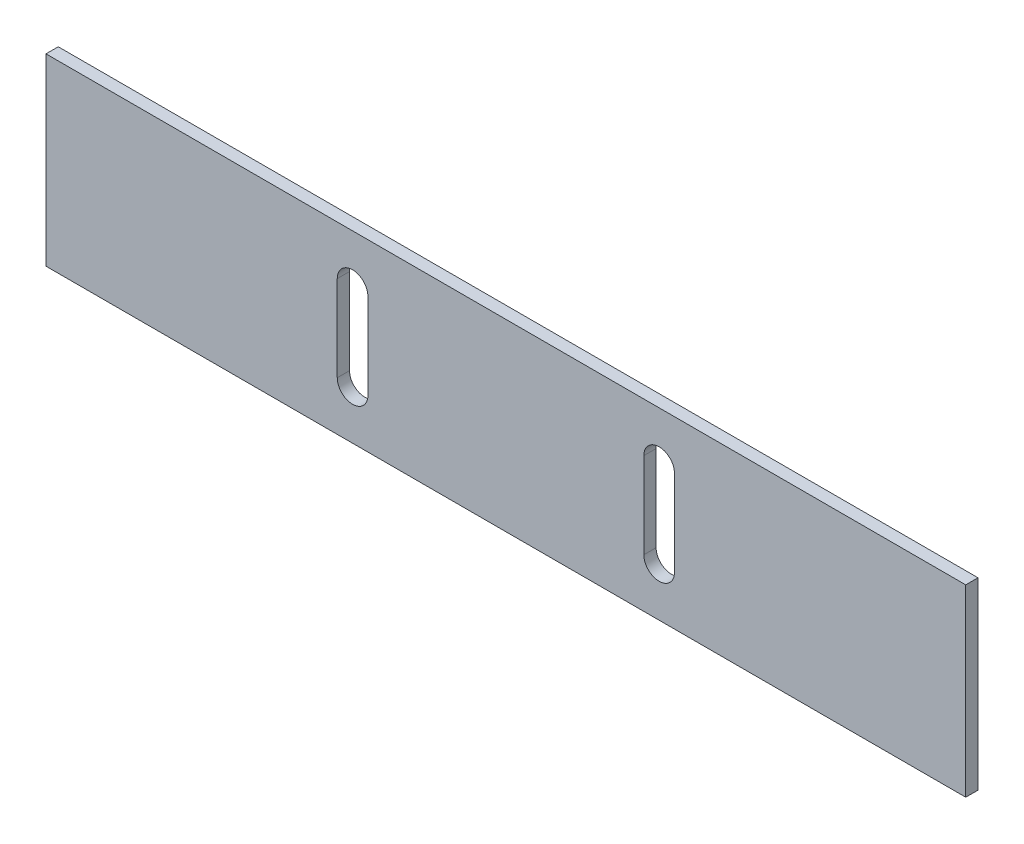
ISO-10303-21;
HEADER;
FILE_DESCRIPTION(('STEP AP214'),'2;1');
FILE_NAME('part.step','',(''),(''),'','','');
FILE_SCHEMA(('AUTOMOTIVE_DESIGN { 1 0 10303 214 1 1 1 1 }'));
ENDSEC;
DATA;
#1=APPLICATION_CONTEXT('core data for automotive mechanical design processes');
#2=APPLICATION_PROTOCOL_DEFINITION('international standard','automotive_design',2000,#1);
#3=PRODUCT_CONTEXT('',#1,'mechanical');
#4=PRODUCT('Part','Part','',(#3));
#5=PRODUCT_RELATED_PRODUCT_CATEGORY('part','',(#4));
#6=PRODUCT_DEFINITION_FORMATION('','',#4);
#7=PRODUCT_DEFINITION_CONTEXT('part definition',#1,'design');
#8=PRODUCT_DEFINITION('design','',#6,#7);
#9=PRODUCT_DEFINITION_SHAPE('','',#8);
#10=(LENGTH_UNIT() NAMED_UNIT(*) SI_UNIT(.MILLI.,.METRE.));
#11=(NAMED_UNIT(*) PLANE_ANGLE_UNIT() SI_UNIT($,.RADIAN.));
#12=(NAMED_UNIT(*) SI_UNIT($,.STERADIAN.) SOLID_ANGLE_UNIT());
#13=UNCERTAINTY_MEASURE_WITH_UNIT(LENGTH_MEASURE(1.E-05),#10,'distance_accuracy_value','');
#14=(GEOMETRIC_REPRESENTATION_CONTEXT(3) GLOBAL_UNCERTAINTY_ASSIGNED_CONTEXT((#13)) GLOBAL_UNIT_ASSIGNED_CONTEXT((#10,
#11,#12)) REPRESENTATION_CONTEXT('',''));
#15=CARTESIAN_POINT('',(0.,0.,0.));
#16=DIRECTION('',(0.,0.,1.));
#17=DIRECTION('',(1.,0.,0.));
#18=AXIS2_PLACEMENT_3D('',#15,#16,#17);
#19=CARTESIAN_POINT('',(0.,0.,2.));
#20=DIRECTION('',(0.,0.,-1.));
#21=DIRECTION('',(-1.,0.,0.));
#22=AXIS2_PLACEMENT_3D('',#19,#20,#21);
#23=PLANE('',#22);
#24=CARTESIAN_POINT('',(50.,22.,2.));
#25=DIRECTION('',(0.,0.,1.));
#26=DIRECTION('',(-1.,0.,0.));
#27=AXIS2_PLACEMENT_3D('',#24,#25,#26);
#28=CIRCLE('',#27,2.5);
#29=CARTESIAN_POINT('',(52.5,22.,2.));
#30=VERTEX_POINT('',#29);
#31=CARTESIAN_POINT('',(47.5,22.,2.));
#32=VERTEX_POINT('',#31);
#33=EDGE_CURVE('E161',#30,#32,#28,.T.);
#34=ORIENTED_EDGE('',*,*,#33,.F.);
#35=DIRECTION('',(0.,1.,0.));
#36=VECTOR('',#35,1.);
#37=CARTESIAN_POINT('',(52.5,22.,2.));
#38=LINE('',#37,#36);
#39=CARTESIAN_POINT('',(52.5,8.,2.));
#40=VERTEX_POINT('',#39);
#41=EDGE_CURVE('E169',#40,#30,#38,.T.);
#42=ORIENTED_EDGE('',*,*,#41,.F.);
#43=CARTESIAN_POINT('',(50.,8.,2.));
#44=DIRECTION('',(0.,0.,1.));
#45=DIRECTION('',(1.,0.,0.));
#46=AXIS2_PLACEMENT_3D('',#43,#44,#45);
#47=CIRCLE('',#46,2.5);
#48=CARTESIAN_POINT('',(47.5,8.,2.));
#49=VERTEX_POINT('',#48);
#50=EDGE_CURVE('E166',#49,#40,#47,.T.);
#51=ORIENTED_EDGE('',*,*,#50,.F.);
#52=DIRECTION('',(0.,-1.,0.));
#53=VECTOR('',#52,1.);
#54=CARTESIAN_POINT('',(47.5,8.,2.));
#55=LINE('',#54,#53);
#56=EDGE_CURVE('E163',#32,#49,#55,.T.);
#57=ORIENTED_EDGE('',*,*,#56,.F.);
#58=EDGE_LOOP('',(#34,#42,#51,#57));
#59=FACE_BOUND('',#58,.T.);
#60=DIRECTION('',(0.,-1.,0.));
#61=VECTOR('',#60,1.);
#62=CARTESIAN_POINT('',(0.,0.,2.));
#63=LINE('',#62,#61);
#64=CARTESIAN_POINT('',(0.,30.,2.));
#65=VERTEX_POINT('',#64);
#66=CARTESIAN_POINT('',(0.,0.,2.));
#67=VERTEX_POINT('',#66);
#68=EDGE_CURVE('E192',#65,#67,#63,.T.);
#69=ORIENTED_EDGE('',*,*,#68,.T.);
#70=DIRECTION('',(1.,0.,0.));
#71=VECTOR('',#70,1.);
#72=CARTESIAN_POINT('',(0.,0.,2.));
#73=LINE('',#72,#71);
#74=CARTESIAN_POINT('',(150.,0.,2.));
#75=VERTEX_POINT('',#74);
#76=EDGE_CURVE('E195',#67,#75,#73,.T.);
#77=ORIENTED_EDGE('',*,*,#76,.T.);
#78=DIRECTION('',(0.,1.,0.));
#79=VECTOR('',#78,1.);
#80=CARTESIAN_POINT('',(150.,0.,2.));
#81=LINE('',#80,#79);
#82=CARTESIAN_POINT('',(150.,30.,2.));
#83=VERTEX_POINT('',#82);
#84=EDGE_CURVE('E198',#75,#83,#81,.T.);
#85=ORIENTED_EDGE('',*,*,#84,.T.);
#86=DIRECTION('',(-1.,0.,0.));
#87=VECTOR('',#86,1.);
#88=CARTESIAN_POINT('',(0.,30.,2.));
#89=LINE('',#88,#87);
#90=EDGE_CURVE('E200',#83,#65,#89,.T.);
#91=ORIENTED_EDGE('',*,*,#90,.T.);
#92=EDGE_LOOP('',(#69,#77,#85,#91));
#93=FACE_BOUND('',#92,.T.);
#94=CARTESIAN_POINT('',(100.,22.,2.));
#95=DIRECTION('',(0.,0.,1.));
#96=DIRECTION('',(-1.,0.,0.));
#97=AXIS2_PLACEMENT_3D('',#94,#95,#96);
#98=CIRCLE('',#97,2.5);
#99=CARTESIAN_POINT('',(102.5,22.,2.));
#100=VERTEX_POINT('',#99);
#101=CARTESIAN_POINT('',(97.5,22.,2.));
#102=VERTEX_POINT('',#101);
#103=EDGE_CURVE('E125',#100,#102,#98,.T.);
#104=ORIENTED_EDGE('',*,*,#103,.F.);
#105=DIRECTION('',(0.,1.,0.));
#106=VECTOR('',#105,1.);
#107=CARTESIAN_POINT('',(102.5,22.,2.));
#108=LINE('',#107,#106);
#109=CARTESIAN_POINT('',(102.5,8.,2.));
#110=VERTEX_POINT('',#109);
#111=EDGE_CURVE('E147',#110,#100,#108,.T.);
#112=ORIENTED_EDGE('',*,*,#111,.F.);
#113=CARTESIAN_POINT('',(100.,8.,2.));
#114=DIRECTION('',(0.,0.,1.));
#115=DIRECTION('',(1.,0.,0.));
#116=AXIS2_PLACEMENT_3D('',#113,#114,#115);
#117=CIRCLE('',#116,2.5);
#118=CARTESIAN_POINT('',(97.5,8.,2.));
#119=VERTEX_POINT('',#118);
#120=EDGE_CURVE('E145',#119,#110,#117,.T.);
#121=ORIENTED_EDGE('',*,*,#120,.F.);
#122=DIRECTION('',(0.,-1.,0.));
#123=VECTOR('',#122,1.);
#124=CARTESIAN_POINT('',(97.5,8.,2.));
#125=LINE('',#124,#123);
#126=EDGE_CURVE('E133',#102,#119,#125,.T.);
#127=ORIENTED_EDGE('',*,*,#126,.F.);
#128=EDGE_LOOP('',(#104,#112,#121,#127));
#129=FACE_BOUND('',#128,.T.);
#130=ADVANCED_FACE('F36',(#59,#93,#129),#23,.F.);
#131=CARTESIAN_POINT('',(0.,0.,0.));
#132=DIRECTION('',(0.,0.,-1.));
#133=DIRECTION('',(-1.,0.,0.));
#134=AXIS2_PLACEMENT_3D('',#131,#132,#133);
#135=PLANE('',#134);
#136=DIRECTION('',(0.,-1.,0.));
#137=VECTOR('',#136,1.);
#138=CARTESIAN_POINT('',(0.,0.,0.));
#139=LINE('',#138,#137);
#140=CARTESIAN_POINT('',(0.,30.,0.));
#141=VERTEX_POINT('',#140);
#142=CARTESIAN_POINT('',(0.,0.,0.));
#143=VERTEX_POINT('',#142);
#144=EDGE_CURVE('E191',#141,#143,#139,.T.);
#145=ORIENTED_EDGE('',*,*,#144,.F.);
#146=DIRECTION('',(-1.,0.,0.));
#147=VECTOR('',#146,1.);
#148=CARTESIAN_POINT('',(0.,30.,0.));
#149=LINE('',#148,#147);
#150=CARTESIAN_POINT('',(150.,30.,0.));
#151=VERTEX_POINT('',#150);
#152=EDGE_CURVE('E196',#151,#141,#149,.T.);
#153=ORIENTED_EDGE('',*,*,#152,.F.);
#154=DIRECTION('',(0.,1.,0.));
#155=VECTOR('',#154,1.);
#156=CARTESIAN_POINT('',(150.,0.,0.));
#157=LINE('',#156,#155);
#158=CARTESIAN_POINT('',(150.,0.,0.));
#159=VERTEX_POINT('',#158);
#160=EDGE_CURVE('E207',#159,#151,#157,.T.);
#161=ORIENTED_EDGE('',*,*,#160,.F.);
#162=DIRECTION('',(1.,0.,0.));
#163=VECTOR('',#162,1.);
#164=CARTESIAN_POINT('',(0.,0.,0.));
#165=LINE('',#164,#163);
#166=EDGE_CURVE('E205',#143,#159,#165,.T.);
#167=ORIENTED_EDGE('',*,*,#166,.F.);
#168=EDGE_LOOP('',(#145,#153,#161,#167));
#169=FACE_BOUND('',#168,.T.);
#170=DIRECTION('',(0.,1.,0.));
#171=VECTOR('',#170,1.);
#172=CARTESIAN_POINT('',(52.5,22.,0.));
#173=LINE('',#172,#171);
#174=CARTESIAN_POINT('',(52.5,8.,0.));
#175=VERTEX_POINT('',#174);
#176=CARTESIAN_POINT('',(52.5,22.,0.));
#177=VERTEX_POINT('',#176);
#178=EDGE_CURVE('E164',#175,#177,#173,.T.);
#179=ORIENTED_EDGE('',*,*,#178,.T.);
#180=CARTESIAN_POINT('',(50.,22.,0.));
#181=DIRECTION('',(0.,0.,1.));
#182=DIRECTION('',(-1.,0.,0.));
#183=AXIS2_PLACEMENT_3D('',#180,#181,#182);
#184=CIRCLE('',#183,2.5);
#185=CARTESIAN_POINT('',(47.5,22.,0.));
#186=VERTEX_POINT('',#185);
#187=EDGE_CURVE('E141',#177,#186,#184,.T.);
#188=ORIENTED_EDGE('',*,*,#187,.T.);
#189=DIRECTION('',(0.,-1.,0.));
#190=VECTOR('',#189,1.);
#191=CARTESIAN_POINT('',(47.5,8.,0.));
#192=LINE('',#191,#190);
#193=CARTESIAN_POINT('',(47.5,8.,0.));
#194=VERTEX_POINT('',#193);
#195=EDGE_CURVE('E174',#186,#194,#192,.T.);
#196=ORIENTED_EDGE('',*,*,#195,.T.);
#197=CARTESIAN_POINT('',(50.,8.,0.));
#198=DIRECTION('',(0.,0.,1.));
#199=DIRECTION('',(1.,0.,0.));
#200=AXIS2_PLACEMENT_3D('',#197,#198,#199);
#201=CIRCLE('',#200,2.5);
#202=EDGE_CURVE('E177',#194,#175,#201,.T.);
#203=ORIENTED_EDGE('',*,*,#202,.T.);
#204=EDGE_LOOP('',(#179,#188,#196,#203));
#205=FACE_BOUND('',#204,.T.);
#206=DIRECTION('',(0.,1.,0.));
#207=VECTOR('',#206,1.);
#208=CARTESIAN_POINT('',(102.5,22.,0.));
#209=LINE('',#208,#207);
#210=CARTESIAN_POINT('',(102.5,8.,0.));
#211=VERTEX_POINT('',#210);
#212=CARTESIAN_POINT('',(102.5,22.,0.));
#213=VERTEX_POINT('',#212);
#214=EDGE_CURVE('E134',#211,#213,#209,.T.);
#215=ORIENTED_EDGE('',*,*,#214,.T.);
#216=CARTESIAN_POINT('',(100.,22.,0.));
#217=DIRECTION('',(0.,0.,1.));
#218=DIRECTION('',(-1.,0.,0.));
#219=AXIS2_PLACEMENT_3D('',#216,#217,#218);
#220=CIRCLE('',#219,2.5);
#221=CARTESIAN_POINT('',(97.5,22.,0.));
#222=VERTEX_POINT('',#221);
#223=EDGE_CURVE('E59',#213,#222,#220,.T.);
#224=ORIENTED_EDGE('',*,*,#223,.T.);
#225=DIRECTION('',(0.,-1.,0.));
#226=VECTOR('',#225,1.);
#227=CARTESIAN_POINT('',(97.5,8.,0.));
#228=LINE('',#227,#226);
#229=CARTESIAN_POINT('',(97.5,8.,0.));
#230=VERTEX_POINT('',#229);
#231=EDGE_CURVE('E140',#222,#230,#228,.T.);
#232=ORIENTED_EDGE('',*,*,#231,.T.);
#233=CARTESIAN_POINT('',(100.,8.,0.));
#234=DIRECTION('',(0.,0.,1.));
#235=DIRECTION('',(1.,0.,0.));
#236=AXIS2_PLACEMENT_3D('',#233,#234,#235);
#237=CIRCLE('',#236,2.5);
#238=EDGE_CURVE('E153',#230,#211,#237,.T.);
#239=ORIENTED_EDGE('',*,*,#238,.T.);
#240=EDGE_LOOP('',(#215,#224,#232,#239));
#241=FACE_BOUND('',#240,.T.);
#242=ADVANCED_FACE('F225',(#169,#205,#241),#135,.T.);
#243=CARTESIAN_POINT('',(0.,0.,2.));
#244=DIRECTION('',(1.,0.,0.));
#245=DIRECTION('',(0.,0.,-1.));
#246=AXIS2_PLACEMENT_3D('',#243,#244,#245);
#247=PLANE('',#246);
#248=ORIENTED_EDGE('',*,*,#144,.T.);
#249=DIRECTION('',(0.,0.,-1.));
#250=VECTOR('',#249,1.);
#251=CARTESIAN_POINT('',(0.,0.,2.));
#252=LINE('',#251,#250);
#253=EDGE_CURVE('E11',#67,#143,#252,.T.);
#254=ORIENTED_EDGE('',*,*,#253,.F.);
#255=ORIENTED_EDGE('',*,*,#68,.F.);
#256=DIRECTION('',(0.,0.,-1.));
#257=VECTOR('',#256,1.);
#258=CARTESIAN_POINT('',(0.,30.,2.));
#259=LINE('',#258,#257);
#260=EDGE_CURVE('E202',#65,#141,#259,.T.);
#261=ORIENTED_EDGE('',*,*,#260,.T.);
#262=EDGE_LOOP('',(#248,#254,#255,#261));
#263=FACE_BOUND('',#262,.T.);
#264=ADVANCED_FACE('F38',(#263),#247,.F.);
#265=CARTESIAN_POINT('',(0.,0.,2.));
#266=DIRECTION('',(0.,1.,0.));
#267=DIRECTION('',(0.,0.,1.));
#268=AXIS2_PLACEMENT_3D('',#265,#266,#267);
#269=PLANE('',#268);
#270=ORIENTED_EDGE('',*,*,#166,.T.);
#271=DIRECTION('',(0.,0.,-1.));
#272=VECTOR('',#271,1.);
#273=CARTESIAN_POINT('',(150.,0.,2.));
#274=LINE('',#273,#272);
#275=EDGE_CURVE('E44',#75,#159,#274,.T.);
#276=ORIENTED_EDGE('',*,*,#275,.F.);
#277=ORIENTED_EDGE('',*,*,#76,.F.);
#278=ORIENTED_EDGE('',*,*,#253,.T.);
#279=EDGE_LOOP('',(#270,#276,#277,#278));
#280=FACE_BOUND('',#279,.T.);
#281=ADVANCED_FACE('F235',(#280),#269,.F.);
#282=CARTESIAN_POINT('',(150.,0.,2.));
#283=DIRECTION('',(-1.,0.,0.));
#284=DIRECTION('',(0.,0.,1.));
#285=AXIS2_PLACEMENT_3D('',#282,#283,#284);
#286=PLANE('',#285);
#287=ORIENTED_EDGE('',*,*,#160,.T.);
#288=DIRECTION('',(0.,0.,-1.));
#289=VECTOR('',#288,1.);
#290=CARTESIAN_POINT('',(150.,30.,2.));
#291=LINE('',#290,#289);
#292=EDGE_CURVE('E212',#83,#151,#291,.T.);
#293=ORIENTED_EDGE('',*,*,#292,.F.);
#294=ORIENTED_EDGE('',*,*,#84,.F.);
#295=ORIENTED_EDGE('',*,*,#275,.T.);
#296=EDGE_LOOP('',(#287,#293,#294,#295));
#297=FACE_BOUND('',#296,.T.);
#298=ADVANCED_FACE('F219',(#297),#286,.F.);
#299=CARTESIAN_POINT('',(0.,30.,2.));
#300=DIRECTION('',(0.,-1.,0.));
#301=DIRECTION('',(0.,0.,-1.));
#302=AXIS2_PLACEMENT_3D('',#299,#300,#301);
#303=PLANE('',#302);
#304=ORIENTED_EDGE('',*,*,#152,.T.);
#305=ORIENTED_EDGE('',*,*,#260,.F.);
#306=ORIENTED_EDGE('',*,*,#90,.F.);
#307=ORIENTED_EDGE('',*,*,#292,.T.);
#308=EDGE_LOOP('',(#304,#305,#306,#307));
#309=FACE_BOUND('',#308,.T.);
#310=ADVANCED_FACE('F229',(#309),#303,.F.);
#311=CARTESIAN_POINT('',(50.,22.,2.));
#312=DIRECTION('',(0.,0.,-1.));
#313=DIRECTION('',(-1.,0.,0.));
#314=AXIS2_PLACEMENT_3D('',#311,#312,#313);
#315=CYLINDRICAL_SURFACE('',#314,2.5);
#316=ORIENTED_EDGE('',*,*,#187,.F.);
#317=DIRECTION('',(0.,0.,-1.));
#318=VECTOR('',#317,1.);
#319=CARTESIAN_POINT('',(52.5,22.,2.));
#320=LINE('',#319,#318);
#321=EDGE_CURVE('E171',#30,#177,#320,.T.);
#322=ORIENTED_EDGE('',*,*,#321,.F.);
#323=ORIENTED_EDGE('',*,*,#33,.T.);
#324=DIRECTION('',(0.,0.,-1.));
#325=VECTOR('',#324,1.);
#326=CARTESIAN_POINT('',(47.5,22.,2.));
#327=LINE('',#326,#325);
#328=EDGE_CURVE('E188',#32,#186,#327,.T.);
#329=ORIENTED_EDGE('',*,*,#328,.T.);
#330=EDGE_LOOP('',(#316,#322,#323,#329));
#331=FACE_BOUND('',#330,.T.);
#332=ADVANCED_FACE('F251',(#331),#315,.F.);
#333=CARTESIAN_POINT('',(47.5,8.,2.));
#334=DIRECTION('',(1.,0.,0.));
#335=DIRECTION('',(0.,0.,-1.));
#336=AXIS2_PLACEMENT_3D('',#333,#334,#335);
#337=PLANE('',#336);
#338=ORIENTED_EDGE('',*,*,#195,.F.);
#339=ORIENTED_EDGE('',*,*,#328,.F.);
#340=ORIENTED_EDGE('',*,*,#56,.T.);
#341=DIRECTION('',(0.,0.,-1.));
#342=VECTOR('',#341,1.);
#343=CARTESIAN_POINT('',(47.5,8.,2.));
#344=LINE('',#343,#342);
#345=EDGE_CURVE('E186',#49,#194,#344,.T.);
#346=ORIENTED_EDGE('',*,*,#345,.T.);
#347=EDGE_LOOP('',(#338,#339,#340,#346));
#348=FACE_BOUND('',#347,.T.);
#349=ADVANCED_FACE('F258',(#348),#337,.T.);
#350=CARTESIAN_POINT('',(50.,8.,2.));
#351=DIRECTION('',(0.,0.,-1.));
#352=DIRECTION('',(-1.,0.,0.));
#353=AXIS2_PLACEMENT_3D('',#350,#351,#352);
#354=CYLINDRICAL_SURFACE('',#353,2.5);
#355=ORIENTED_EDGE('',*,*,#202,.F.);
#356=ORIENTED_EDGE('',*,*,#345,.F.);
#357=ORIENTED_EDGE('',*,*,#50,.T.);
#358=DIRECTION('',(0.,0.,-1.));
#359=VECTOR('',#358,1.);
#360=CARTESIAN_POINT('',(52.5,8.,2.));
#361=LINE('',#360,#359);
#362=EDGE_CURVE('E184',#40,#175,#361,.T.);
#363=ORIENTED_EDGE('',*,*,#362,.T.);
#364=EDGE_LOOP('',(#355,#356,#357,#363));
#365=FACE_BOUND('',#364,.T.);
#366=ADVANCED_FACE('F263',(#365),#354,.F.);
#367=CARTESIAN_POINT('',(52.5,22.,2.));
#368=DIRECTION('',(-1.,0.,0.));
#369=DIRECTION('',(0.,0.,1.));
#370=AXIS2_PLACEMENT_3D('',#367,#368,#369);
#371=PLANE('',#370);
#372=ORIENTED_EDGE('',*,*,#178,.F.);
#373=ORIENTED_EDGE('',*,*,#362,.F.);
#374=ORIENTED_EDGE('',*,*,#41,.T.);
#375=ORIENTED_EDGE('',*,*,#321,.T.);
#376=EDGE_LOOP('',(#372,#373,#374,#375));
#377=FACE_BOUND('',#376,.T.);
#378=ADVANCED_FACE('F269',(#377),#371,.T.);
#379=CARTESIAN_POINT('',(100.,22.,2.));
#380=DIRECTION('',(0.,0.,-1.));
#381=DIRECTION('',(-1.,0.,0.));
#382=AXIS2_PLACEMENT_3D('',#379,#380,#381);
#383=CYLINDRICAL_SURFACE('',#382,2.5);
#384=ORIENTED_EDGE('',*,*,#223,.F.);
#385=DIRECTION('',(0.,0.,-1.));
#386=VECTOR('',#385,1.);
#387=CARTESIAN_POINT('',(102.5,22.,2.));
#388=LINE('',#387,#386);
#389=EDGE_CURVE('E129',#100,#213,#388,.T.);
#390=ORIENTED_EDGE('',*,*,#389,.F.);
#391=ORIENTED_EDGE('',*,*,#103,.T.);
#392=DIRECTION('',(0.,0.,-1.));
#393=VECTOR('',#392,1.);
#394=CARTESIAN_POINT('',(97.5,22.,2.));
#395=LINE('',#394,#393);
#396=EDGE_CURVE('E128',#102,#222,#395,.T.);
#397=ORIENTED_EDGE('',*,*,#396,.T.);
#398=EDGE_LOOP('',(#384,#390,#391,#397));
#399=FACE_BOUND('',#398,.T.);
#400=ADVANCED_FACE('F127',(#399),#383,.F.);
#401=CARTESIAN_POINT('',(97.5,8.,2.));
#402=DIRECTION('',(1.,0.,0.));
#403=DIRECTION('',(0.,0.,-1.));
#404=AXIS2_PLACEMENT_3D('',#401,#402,#403);
#405=PLANE('',#404);
#406=ORIENTED_EDGE('',*,*,#231,.F.);
#407=ORIENTED_EDGE('',*,*,#396,.F.);
#408=ORIENTED_EDGE('',*,*,#126,.T.);
#409=DIRECTION('',(0.,0.,-1.));
#410=VECTOR('',#409,1.);
#411=CARTESIAN_POINT('',(97.5,8.,2.));
#412=LINE('',#411,#410);
#413=EDGE_CURVE('E142',#119,#230,#412,.T.);
#414=ORIENTED_EDGE('',*,*,#413,.T.);
#415=EDGE_LOOP('',(#406,#407,#408,#414));
#416=FACE_BOUND('',#415,.T.);
#417=ADVANCED_FACE('F137',(#416),#405,.T.);
#418=CARTESIAN_POINT('',(100.,8.,2.));
#419=DIRECTION('',(0.,0.,-1.));
#420=DIRECTION('',(-1.,0.,0.));
#421=AXIS2_PLACEMENT_3D('',#418,#419,#420);
#422=CYLINDRICAL_SURFACE('',#421,2.5);
#423=ORIENTED_EDGE('',*,*,#238,.F.);
#424=ORIENTED_EDGE('',*,*,#413,.F.);
#425=ORIENTED_EDGE('',*,*,#120,.T.);
#426=DIRECTION('',(0.,0.,-1.));
#427=VECTOR('',#426,1.);
#428=CARTESIAN_POINT('',(102.5,8.,2.));
#429=LINE('',#428,#427);
#430=EDGE_CURVE('E51',#110,#211,#429,.T.);
#431=ORIENTED_EDGE('',*,*,#430,.T.);
#432=EDGE_LOOP('',(#423,#424,#425,#431));
#433=FACE_BOUND('',#432,.T.);
#434=ADVANCED_FACE('F288',(#433),#422,.F.);
#435=CARTESIAN_POINT('',(102.5,22.,2.));
#436=DIRECTION('',(-1.,0.,0.));
#437=DIRECTION('',(0.,0.,1.));
#438=AXIS2_PLACEMENT_3D('',#435,#436,#437);
#439=PLANE('',#438);
#440=ORIENTED_EDGE('',*,*,#214,.F.);
#441=ORIENTED_EDGE('',*,*,#430,.F.);
#442=ORIENTED_EDGE('',*,*,#111,.T.);
#443=ORIENTED_EDGE('',*,*,#389,.T.);
#444=EDGE_LOOP('',(#440,#441,#442,#443));
#445=FACE_BOUND('',#444,.T.);
#446=ADVANCED_FACE('F291',(#445),#439,.T.);
#447=CLOSED_SHELL('',(#130,#242,#264,#281,#298,#310,#332,#349,#366,#378,#400,#417,#434,#446));
#448=MANIFOLD_SOLID_BREP('B2',#447);
#449=ADVANCED_BREP_SHAPE_REPRESENTATION('',(#18,#448),#14);
#450=SHAPE_DEFINITION_REPRESENTATION(#9,#449);
ENDSEC;
END-ISO-10303-21;
